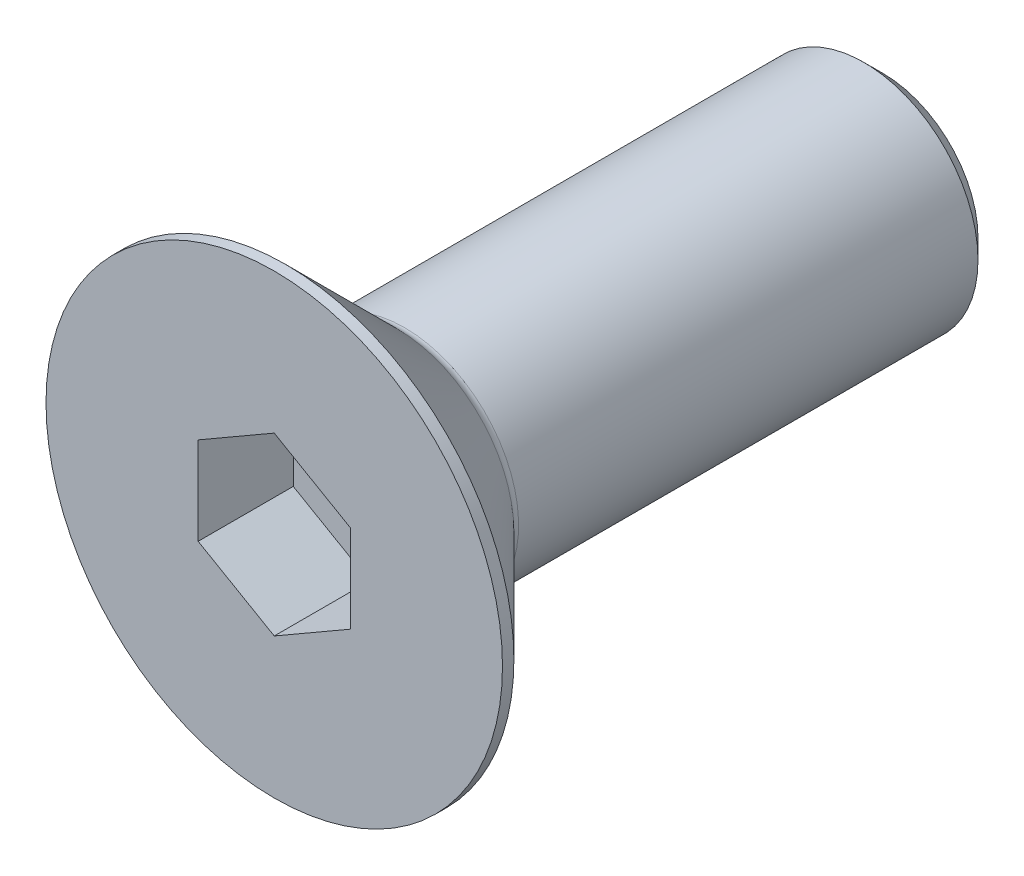
ISO-10303-21;
HEADER;
FILE_DESCRIPTION(('STEP AP214'),'2;1');
FILE_NAME('part.step','',(''),(''),'','','');
FILE_SCHEMA(('AUTOMOTIVE_DESIGN { 1 0 10303 214 1 1 1 1 }'));
ENDSEC;
DATA;
#1=APPLICATION_CONTEXT('core data for automotive mechanical design processes');
#2=APPLICATION_PROTOCOL_DEFINITION('international standard','automotive_design',2000,#1);
#3=PRODUCT_CONTEXT('',#1,'mechanical');
#4=PRODUCT('Part','Part','',(#3));
#5=PRODUCT_RELATED_PRODUCT_CATEGORY('part','',(#4));
#6=PRODUCT_DEFINITION_FORMATION('','',#4);
#7=PRODUCT_DEFINITION_CONTEXT('part definition',#1,'design');
#8=PRODUCT_DEFINITION('design','',#6,#7);
#9=PRODUCT_DEFINITION_SHAPE('','',#8);
#10=(LENGTH_UNIT() NAMED_UNIT(*) SI_UNIT(.MILLI.,.METRE.));
#11=(NAMED_UNIT(*) PLANE_ANGLE_UNIT() SI_UNIT($,.RADIAN.));
#12=(NAMED_UNIT(*) SI_UNIT($,.STERADIAN.) SOLID_ANGLE_UNIT());
#13=UNCERTAINTY_MEASURE_WITH_UNIT(LENGTH_MEASURE(1.E-05),#10,'distance_accuracy_value','');
#14=(GEOMETRIC_REPRESENTATION_CONTEXT(3) GLOBAL_UNCERTAINTY_ASSIGNED_CONTEXT((#13)) GLOBAL_UNIT_ASSIGNED_CONTEXT((#10,
#11,#12)) REPRESENTATION_CONTEXT('',''));
#15=CARTESIAN_POINT('',(0.,0.,0.));
#16=DIRECTION('',(0.,0.,1.));
#17=DIRECTION('',(1.,0.,0.));
#18=AXIS2_PLACEMENT_3D('',#15,#16,#17);
#19=CARTESIAN_POINT('',(0.,0.,-2.5));
#20=DIRECTION('',(0.,0.,1.));
#21=DIRECTION('',(1.,0.,0.));
#22=AXIS2_PLACEMENT_3D('',#19,#20,#21);
#23=PLANE('',#22);
#24=DIRECTION('',(-0.866025403784439,-0.5,0.));
#25=VECTOR('',#24,1.);
#26=CARTESIAN_POINT('',(0.,2.3094010767585,-2.5));
#27=LINE('',#26,#25);
#28=CARTESIAN_POINT('',(0.,2.3094010767585,-2.5));
#29=VERTEX_POINT('',#28);
#30=CARTESIAN_POINT('',(-2.,1.15470053837925,-2.5));
#31=VERTEX_POINT('',#30);
#32=EDGE_CURVE('E83',#29,#31,#27,.T.);
#33=ORIENTED_EDGE('',*,*,#32,.T.);
#34=DIRECTION('',(0.,1.,0.));
#35=VECTOR('',#34,1.);
#36=CARTESIAN_POINT('',(-2.,1.15470053837925,-2.5));
#37=LINE('',#36,#35);
#38=CARTESIAN_POINT('',(-2.,-1.15470053837925,-2.5));
#39=VERTEX_POINT('',#38);
#40=EDGE_CURVE('E67',#31,#39,#37,.F.);
#41=ORIENTED_EDGE('',*,*,#40,.T.);
#42=DIRECTION('',(0.866025403784439,-0.499999999999999,0.));
#43=VECTOR('',#42,1.);
#44=CARTESIAN_POINT('',(-2.,-1.15470053837925,-2.5));
#45=LINE('',#44,#43);
#46=CARTESIAN_POINT('',(0.,-2.3094010767585,-2.5));
#47=VERTEX_POINT('',#46);
#48=EDGE_CURVE('E72',#39,#47,#45,.T.);
#49=ORIENTED_EDGE('',*,*,#48,.T.);
#50=DIRECTION('',(0.866025403784439,0.5,0.));
#51=VECTOR('',#50,1.);
#52=CARTESIAN_POINT('',(0.,-2.3094010767585,-2.5));
#53=LINE('',#52,#51);
#54=CARTESIAN_POINT('',(2.,-1.15470053837925,-2.5));
#55=VERTEX_POINT('',#54);
#56=EDGE_CURVE('E129',#47,#55,#53,.T.);
#57=ORIENTED_EDGE('',*,*,#56,.T.);
#58=DIRECTION('',(0.,1.,0.));
#59=VECTOR('',#58,1.);
#60=CARTESIAN_POINT('',(2.,-1.15470053837925,-2.5));
#61=LINE('',#60,#59);
#62=CARTESIAN_POINT('',(2.,1.15470053837925,-2.5));
#63=VERTEX_POINT('',#62);
#64=EDGE_CURVE('E133',#55,#63,#61,.T.);
#65=ORIENTED_EDGE('',*,*,#64,.T.);
#66=DIRECTION('',(-0.866025403784439,0.499999999999999,0.));
#67=VECTOR('',#66,1.);
#68=CARTESIAN_POINT('',(2.,1.15470053837925,-2.5));
#69=LINE('',#68,#67);
#70=EDGE_CURVE('E138',#63,#29,#69,.T.);
#71=ORIENTED_EDGE('',*,*,#70,.T.);
#72=EDGE_LOOP('',(#33,#41,#49,#57,#65,#71));
#73=FACE_BOUND('',#72,.T.);
#74=ADVANCED_FACE('F16',(#73),#23,.T.);
#75=CARTESIAN_POINT('',(-2.,-1.15470053837925,0.));
#76=DIRECTION('',(-0.499999999999999,-0.866025403784439,0.));
#77=DIRECTION('',(0.866025403784439,-0.499999999999999,0.));
#78=AXIS2_PLACEMENT_3D('',#75,#76,#77);
#79=PLANE('',#78);
#80=DIRECTION('',(0.,0.,1.));
#81=VECTOR('',#80,1.);
#82=CARTESIAN_POINT('',(-2.,-1.15470053837925,0.));
#83=LINE('',#82,#81);
#84=CARTESIAN_POINT('',(-2.,-1.15470053837925,0.));
#85=VERTEX_POINT('',#84);
#86=EDGE_CURVE('E74',#39,#85,#83,.T.);
#87=ORIENTED_EDGE('',*,*,#86,.T.);
#88=DIRECTION('',(-0.866025403784439,0.499999999999999,0.));
#89=VECTOR('',#88,1.);
#90=CARTESIAN_POINT('',(0.,-2.3094010767585,0.));
#91=LINE('',#90,#89);
#92=CARTESIAN_POINT('',(0.,-2.3094010767585,0.));
#93=VERTEX_POINT('',#92);
#94=EDGE_CURVE('E127',#93,#85,#91,.T.);
#95=ORIENTED_EDGE('',*,*,#94,.F.);
#96=DIRECTION('',(0.,0.,1.));
#97=VECTOR('',#96,1.);
#98=CARTESIAN_POINT('',(0.,-2.3094010767585,0.));
#99=LINE('',#98,#97);
#100=EDGE_CURVE('E77',#93,#47,#99,.F.);
#101=ORIENTED_EDGE('',*,*,#100,.T.);
#102=ORIENTED_EDGE('',*,*,#48,.F.);
#103=EDGE_LOOP('',(#87,#95,#101,#102));
#104=FACE_BOUND('',#103,.T.);
#105=ADVANCED_FACE('F73',(#104),#79,.F.);
#106=CARTESIAN_POINT('',(-2.,1.15470053837925,0.));
#107=DIRECTION('',(-1.,0.,0.));
#108=DIRECTION('',(0.,0.,1.));
#109=AXIS2_PLACEMENT_3D('',#106,#107,#108);
#110=PLANE('',#109);
#111=DIRECTION('',(0.,0.,1.));
#112=VECTOR('',#111,1.);
#113=CARTESIAN_POINT('',(-2.,1.15470053837925,0.));
#114=LINE('',#113,#112);
#115=CARTESIAN_POINT('',(-2.,1.15470053837925,0.));
#116=VERTEX_POINT('',#115);
#117=EDGE_CURVE('E85',#31,#116,#114,.T.);
#118=ORIENTED_EDGE('',*,*,#117,.T.);
#119=DIRECTION('',(0.,1.,0.));
#120=VECTOR('',#119,1.);
#121=CARTESIAN_POINT('',(-2.,0.,0.));
#122=LINE('',#121,#120);
#123=EDGE_CURVE('E89',#85,#116,#122,.T.);
#124=ORIENTED_EDGE('',*,*,#123,.F.);
#125=ORIENTED_EDGE('',*,*,#86,.F.);
#126=ORIENTED_EDGE('',*,*,#40,.F.);
#127=EDGE_LOOP('',(#118,#124,#125,#126));
#128=FACE_BOUND('',#127,.T.);
#129=ADVANCED_FACE('F87',(#128),#110,.F.);
#130=CARTESIAN_POINT('',(0.,2.3094010767585,0.));
#131=DIRECTION('',(-0.5,0.866025403784439,0.));
#132=DIRECTION('',(-0.866025403784439,-0.5,0.));
#133=AXIS2_PLACEMENT_3D('',#130,#131,#132);
#134=PLANE('',#133);
#135=DIRECTION('',(0.,0.,1.));
#136=VECTOR('',#135,1.);
#137=CARTESIAN_POINT('',(0.,2.3094010767585,0.));
#138=LINE('',#137,#136);
#139=CARTESIAN_POINT('',(0.,2.3094010767585,0.));
#140=VERTEX_POINT('',#139);
#141=EDGE_CURVE('E140',#29,#140,#138,.T.);
#142=ORIENTED_EDGE('',*,*,#141,.T.);
#143=DIRECTION('',(0.866025403784439,0.5,0.));
#144=VECTOR('',#143,1.);
#145=CARTESIAN_POINT('',(-2.,1.15470053837925,0.));
#146=LINE('',#145,#144);
#147=EDGE_CURVE('E123',#116,#140,#146,.T.);
#148=ORIENTED_EDGE('',*,*,#147,.F.);
#149=ORIENTED_EDGE('',*,*,#117,.F.);
#150=ORIENTED_EDGE('',*,*,#32,.F.);
#151=EDGE_LOOP('',(#142,#148,#149,#150));
#152=FACE_BOUND('',#151,.T.);
#153=ADVANCED_FACE('F144',(#152),#134,.F.);
#154=CARTESIAN_POINT('',(2.,1.15470053837925,0.));
#155=DIRECTION('',(0.499999999999999,0.866025403784439,0.));
#156=DIRECTION('',(-0.866025403784439,0.499999999999999,0.));
#157=AXIS2_PLACEMENT_3D('',#154,#155,#156);
#158=PLANE('',#157);
#159=DIRECTION('',(0.,0.,-1.));
#160=VECTOR('',#159,1.);
#161=CARTESIAN_POINT('',(2.,1.15470053837925,0.));
#162=LINE('',#161,#160);
#163=CARTESIAN_POINT('',(2.,1.15470053837925,0.));
#164=VERTEX_POINT('',#163);
#165=EDGE_CURVE('E136',#63,#164,#162,.F.);
#166=ORIENTED_EDGE('',*,*,#165,.T.);
#167=DIRECTION('',(0.866025403784439,-0.499999999999999,0.));
#168=VECTOR('',#167,1.);
#169=CARTESIAN_POINT('',(0.,2.3094010767585,0.));
#170=LINE('',#169,#168);
#171=EDGE_CURVE('E120',#140,#164,#170,.T.);
#172=ORIENTED_EDGE('',*,*,#171,.F.);
#173=ORIENTED_EDGE('',*,*,#141,.F.);
#174=ORIENTED_EDGE('',*,*,#70,.F.);
#175=EDGE_LOOP('',(#166,#172,#173,#174));
#176=FACE_BOUND('',#175,.T.);
#177=ADVANCED_FACE('F155',(#176),#158,.F.);
#178=CARTESIAN_POINT('',(2.,-1.15470053837925,0.));
#179=DIRECTION('',(1.,0.,0.));
#180=DIRECTION('',(0.,0.,-1.));
#181=AXIS2_PLACEMENT_3D('',#178,#179,#180);
#182=PLANE('',#181);
#183=DIRECTION('',(0.,0.,1.));
#184=VECTOR('',#183,1.);
#185=CARTESIAN_POINT('',(2.,-1.15470053837925,0.));
#186=LINE('',#185,#184);
#187=CARTESIAN_POINT('',(2.,-1.15470053837925,0.));
#188=VERTEX_POINT('',#187);
#189=EDGE_CURVE('E35',#55,#188,#186,.T.);
#190=ORIENTED_EDGE('',*,*,#189,.T.);
#191=DIRECTION('',(0.,1.,0.));
#192=VECTOR('',#191,1.);
#193=CARTESIAN_POINT('',(2.,0.,0.));
#194=LINE('',#193,#192);
#195=EDGE_CURVE('E117',#164,#188,#194,.F.);
#196=ORIENTED_EDGE('',*,*,#195,.F.);
#197=ORIENTED_EDGE('',*,*,#165,.F.);
#198=ORIENTED_EDGE('',*,*,#64,.F.);
#199=EDGE_LOOP('',(#190,#196,#197,#198));
#200=FACE_BOUND('',#199,.T.);
#201=ADVANCED_FACE('F153',(#200),#182,.F.);
#202=CARTESIAN_POINT('',(0.,-2.3094010767585,0.));
#203=DIRECTION('',(0.5,-0.866025403784439,0.));
#204=DIRECTION('',(0.866025403784439,0.5,0.));
#205=AXIS2_PLACEMENT_3D('',#202,#203,#204);
#206=PLANE('',#205);
#207=ORIENTED_EDGE('',*,*,#100,.F.);
#208=DIRECTION('',(-0.866025403784439,-0.5,0.));
#209=VECTOR('',#208,1.);
#210=CARTESIAN_POINT('',(2.,-1.15470053837925,0.));
#211=LINE('',#210,#209);
#212=EDGE_CURVE('E114',#188,#93,#211,.T.);
#213=ORIENTED_EDGE('',*,*,#212,.F.);
#214=ORIENTED_EDGE('',*,*,#189,.F.);
#215=ORIENTED_EDGE('',*,*,#56,.F.);
#216=EDGE_LOOP('',(#207,#213,#214,#215));
#217=FACE_BOUND('',#216,.T.);
#218=ADVANCED_FACE('F151',(#217),#206,.F.);
#219=CARTESIAN_POINT('',(3.,0.,0.));
#220=DIRECTION('',(0.,0.,1.));
#221=DIRECTION('',(1.,0.,0.));
#222=AXIS2_PLACEMENT_3D('',#219,#220,#221);
#223=PLANE('',#222);
#224=ORIENTED_EDGE('',*,*,#195,.T.);
#225=ORIENTED_EDGE('',*,*,#212,.T.);
#226=ORIENTED_EDGE('',*,*,#94,.T.);
#227=ORIENTED_EDGE('',*,*,#123,.T.);
#228=ORIENTED_EDGE('',*,*,#147,.T.);
#229=ORIENTED_EDGE('',*,*,#171,.T.);
#230=EDGE_LOOP('',(#224,#225,#226,#227,#228,#229));
#231=FACE_BOUND('',#230,.T.);
#232=CARTESIAN_POINT('',(0.,0.,0.));
#233=DIRECTION('',(0.,0.,-1.));
#234=DIRECTION('',(-1.,0.,0.));
#235=AXIS2_PLACEMENT_3D('',#232,#233,#234);
#236=CIRCLE('',#235,6.);
#237=CARTESIAN_POINT('',(-6.,0.,0.));
#238=VERTEX_POINT('',#237);
#239=EDGE_CURVE('E20',#238,#238,#236,.T.);
#240=ORIENTED_EDGE('',*,*,#239,.F.);
#241=EDGE_LOOP('',(#240));
#242=FACE_BOUND('',#241,.T.);
#243=ADVANCED_FACE('F148',(#231,#242),#223,.T.);
#244=CARTESIAN_POINT('',(0.,0.,-0.150000000000001));
#245=DIRECTION('',(0.,0.,-1.));
#246=DIRECTION('',(-1.,0.,0.));
#247=AXIS2_PLACEMENT_3D('',#244,#245,#246);
#248=CYLINDRICAL_SURFACE('',#247,6.);
#249=ORIENTED_EDGE('',*,*,#239,.T.);
#250=EDGE_LOOP('',(#249));
#251=FACE_BOUND('',#250,.T.);
#252=CARTESIAN_POINT('',(0.,0.,-0.299999998617295));
#253=DIRECTION('',(0.,0.,1.));
#254=DIRECTION('',(1.,0.,0.));
#255=AXIS2_PLACEMENT_3D('',#252,#253,#254);
#256=CIRCLE('',#255,5.99999999872125);
#257=CARTESIAN_POINT('',(5.99999999872125,0.,-0.299999998617295));
#258=VERTEX_POINT('',#257);
#259=EDGE_CURVE('E101',#258,#258,#256,.F.);
#260=ORIENTED_EDGE('',*,*,#259,.F.);
#261=EDGE_LOOP('',(#260));
#262=FACE_BOUND('',#261,.T.);
#263=ADVANCED_FACE('F184',(#251,#262),#248,.T.);
#264=CARTESIAN_POINT('',(0.,0.,-0.299999998617295));
#265=DIRECTION('',(0.,0.,1.));
#266=DIRECTION('',(1.,0.,0.));
#267=AXIS2_PLACEMENT_3D('',#264,#265,#266);
#268=CONICAL_SURFACE('',#267,5.99999999872125,0.78539816249955);
#269=CARTESIAN_POINT('',(0.,0.,-3.21213203435597));
#270=DIRECTION('',(0.,0.,-1.));
#271=DIRECTION('',(0.,1.,0.));
#272=AXIS2_PLACEMENT_3D('',#269,#270,#271);
#273=CIRCLE('',#272,3.08786796564404);
#274=CARTESIAN_POINT('',(0.,3.08786796564404,-3.21213203435597));
#275=VERTEX_POINT('',#274);
#276=EDGE_CURVE('E95',#275,#275,#273,.T.);
#277=ORIENTED_EDGE('',*,*,#276,.F.);
#278=EDGE_LOOP('',(#277));
#279=FACE_BOUND('',#278,.T.);
#280=ORIENTED_EDGE('',*,*,#259,.T.);
#281=EDGE_LOOP('',(#280));
#282=FACE_BOUND('',#281,.T.);
#283=ADVANCED_FACE('F180',(#279,#282),#268,.T.);
#284=CARTESIAN_POINT('',(1.5,0.,-16.));
#285=DIRECTION('',(0.,0.,-1.));
#286=DIRECTION('',(-1.,0.,0.));
#287=AXIS2_PLACEMENT_3D('',#284,#285,#286);
#288=PLANE('',#287);
#289=CARTESIAN_POINT('',(0.,0.,-16.0000000002469));
#290=DIRECTION('',(0.,0.,1.));
#291=DIRECTION('',(1.,0.,0.));
#292=AXIS2_PLACEMENT_3D('',#289,#290,#291);
#293=CIRCLE('',#292,2.5000000002251);
#294=CARTESIAN_POINT('',(2.5000000002251,0.,-16.0000000002469));
#295=VERTEX_POINT('',#294);
#296=EDGE_CURVE('E93',#295,#295,#293,.T.);
#297=ORIENTED_EDGE('',*,*,#296,.F.);
#298=EDGE_LOOP('',(#297));
#299=FACE_BOUND('',#298,.T.);
#300=ADVANCED_FACE('F177',(#299),#288,.T.);
#301=CARTESIAN_POINT('',(0.,0.,-3.42426406871193));
#302=DIRECTION('',(0.,0.,-1.));
#303=DIRECTION('',(0.,1.,0.));
#304=AXIS2_PLACEMENT_3D('',#301,#302,#303);
#305=TOROIDAL_SURFACE('',#304,3.3,0.3);
#306=CARTESIAN_POINT('',(0.,0.,-3.42426406871193));
#307=DIRECTION('',(0.,0.,-1.));
#308=DIRECTION('',(-1.,0.,0.));
#309=AXIS2_PLACEMENT_3D('',#306,#307,#308);
#310=CIRCLE('',#309,3.);
#311=CARTESIAN_POINT('',(-3.,0.,-3.42426406871193));
#312=VERTEX_POINT('',#311);
#313=EDGE_CURVE('E26',#312,#312,#310,.T.);
#314=ORIENTED_EDGE('',*,*,#313,.F.);
#315=EDGE_LOOP('',(#314));
#316=FACE_BOUND('',#315,.T.);
#317=ORIENTED_EDGE('',*,*,#276,.T.);
#318=EDGE_LOOP('',(#317));
#319=FACE_BOUND('',#318,.T.);
#320=ADVANCED_FACE('F18',(#316,#319),#305,.F.);
#321=CARTESIAN_POINT('',(0.,0.,-15.499999999804));
#322=DIRECTION('',(0.,0.,1.));
#323=DIRECTION('',(1.,0.,0.));
#324=AXIS2_PLACEMENT_3D('',#321,#322,#323);
#325=CONICAL_SURFACE('',#324,2.99999999975853,0.785398162487954);
#326=ORIENTED_EDGE('',*,*,#296,.T.);
#327=EDGE_LOOP('',(#326));
#328=FACE_BOUND('',#327,.T.);
#329=CARTESIAN_POINT('',(0.,0.,-15.5));
#330=DIRECTION('',(0.,0.,-1.));
#331=DIRECTION('',(-1.,0.,0.));
#332=AXIS2_PLACEMENT_3D('',#329,#330,#331);
#333=CIRCLE('',#332,3.);
#334=CARTESIAN_POINT('',(-3.,0.,-15.5));
#335=VERTEX_POINT('',#334);
#336=EDGE_CURVE('E11',#335,#335,#333,.F.);
#337=ORIENTED_EDGE('',*,*,#336,.F.);
#338=EDGE_LOOP('',(#337));
#339=FACE_BOUND('',#338,.T.);
#340=ADVANCED_FACE('F167',(#328,#339),#325,.T.);
#341=CARTESIAN_POINT('',(0.,0.,-9.65));
#342=DIRECTION('',(0.,0.,-1.));
#343=DIRECTION('',(-1.,0.,0.));
#344=AXIS2_PLACEMENT_3D('',#341,#342,#343);
#345=CYLINDRICAL_SURFACE('',#344,3.);
#346=ORIENTED_EDGE('',*,*,#336,.T.);
#347=EDGE_LOOP('',(#346));
#348=FACE_BOUND('',#347,.T.);
#349=ORIENTED_EDGE('',*,*,#313,.T.);
#350=EDGE_LOOP('',(#349));
#351=FACE_BOUND('',#350,.T.);
#352=ADVANCED_FACE('F165',(#348,#351),#345,.T.);
#353=CLOSED_SHELL('',(#74,#105,#129,#153,#177,#201,#218,#243,#263,#283,#300,#320,#340,#352));
#354=MANIFOLD_SOLID_BREP('B1',#353);
#355=ADVANCED_BREP_SHAPE_REPRESENTATION('',(#18,#354),#14);
#356=SHAPE_DEFINITION_REPRESENTATION(#9,#355);
ENDSEC;
END-ISO-10303-21;
